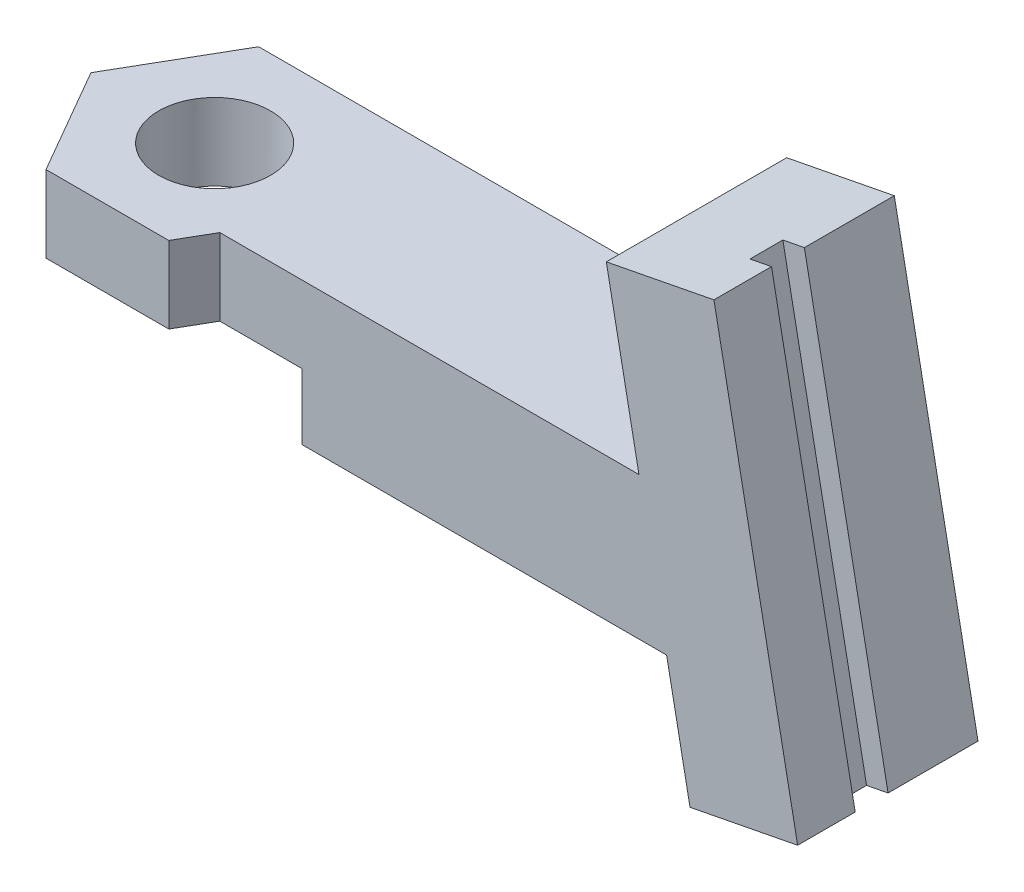
ISO-10303-21;
HEADER;
FILE_DESCRIPTION(('STEP AP214'),'2;1');
FILE_NAME('part.step','',(''),(''),'','','');
FILE_SCHEMA(('AUTOMOTIVE_DESIGN { 1 0 10303 214 1 1 1 1 }'));
ENDSEC;
DATA;
#1=APPLICATION_CONTEXT('core data for automotive mechanical design processes');
#2=APPLICATION_PROTOCOL_DEFINITION('international standard','automotive_design',2000,#1);
#3=PRODUCT_CONTEXT('',#1,'mechanical');
#4=PRODUCT('Part','Part','',(#3));
#5=PRODUCT_RELATED_PRODUCT_CATEGORY('part','',(#4));
#6=PRODUCT_DEFINITION_FORMATION('','',#4);
#7=PRODUCT_DEFINITION_CONTEXT('part definition',#1,'design');
#8=PRODUCT_DEFINITION('design','',#6,#7);
#9=PRODUCT_DEFINITION_SHAPE('','',#8);
#10=(LENGTH_UNIT() NAMED_UNIT(*) SI_UNIT(.MILLI.,.METRE.));
#11=(NAMED_UNIT(*) PLANE_ANGLE_UNIT() SI_UNIT($,.RADIAN.));
#12=(NAMED_UNIT(*) SI_UNIT($,.STERADIAN.) SOLID_ANGLE_UNIT());
#13=UNCERTAINTY_MEASURE_WITH_UNIT(LENGTH_MEASURE(1.E-05),#10,'distance_accuracy_value','');
#14=(GEOMETRIC_REPRESENTATION_CONTEXT(3) GLOBAL_UNCERTAINTY_ASSIGNED_CONTEXT((#13)) GLOBAL_UNIT_ASSIGNED_CONTEXT((#10,
#11,#12)) REPRESENTATION_CONTEXT('',''));
#15=CARTESIAN_POINT('',(0.,0.,0.));
#16=DIRECTION('',(0.,0.,1.));
#17=DIRECTION('',(1.,0.,0.));
#18=AXIS2_PLACEMENT_3D('',#15,#16,#17);
#19=CARTESIAN_POINT('',(2.80014880556968,-14.8169947470239,8.225));
#20=DIRECTION('',(0.866025403784439,0.,0.5));
#21=DIRECTION('',(0.5,0.,-0.866025403784439));
#22=AXIS2_PLACEMENT_3D('',#19,#20,#21);
#23=PLANE('',#22);
#24=DIRECTION('',(0.,1.,0.));
#25=VECTOR('',#24,1.);
#26=CARTESIAN_POINT('',(2.80014880556968,-14.8169947470239,8.225));
#27=LINE('',#26,#25);
#28=CARTESIAN_POINT('',(2.80014880556968,3.,8.225));
#29=VERTEX_POINT('',#28);
#30=CARTESIAN_POINT('',(2.80014880556968,6.5,8.225));
#31=VERTEX_POINT('',#30);
#32=EDGE_CURVE('E245',#29,#31,#27,.T.);
#33=ORIENTED_EDGE('',*,*,#32,.F.);
#34=DIRECTION('',(0.5,0.,-0.866025403784439));
#35=VECTOR('',#34,1.);
#36=CARTESIAN_POINT('',(2.80014880556968,3.,8.225));
#37=LINE('',#36,#35);
#38=CARTESIAN_POINT('',(3.65174045262438,3.,6.75));
#39=VERTEX_POINT('',#38);
#40=EDGE_CURVE('E199',#29,#39,#37,.T.);
#41=ORIENTED_EDGE('',*,*,#40,.T.);
#42=DIRECTION('',(0.,-1.,0.));
#43=VECTOR('',#42,1.);
#44=CARTESIAN_POINT('',(3.65174045262438,6.5,6.75));
#45=LINE('',#44,#43);
#46=CARTESIAN_POINT('',(3.65174045262438,6.5,6.75));
#47=VERTEX_POINT('',#46);
#48=EDGE_CURVE('E227',#47,#39,#45,.T.);
#49=ORIENTED_EDGE('',*,*,#48,.F.);
#50=DIRECTION('',(0.5,0.,-0.866025403784439));
#51=VECTOR('',#50,1.);
#52=CARTESIAN_POINT('',(2.80014880556968,6.5,8.225));
#53=LINE('',#52,#51);
#54=EDGE_CURVE('E237',#31,#47,#53,.T.);
#55=ORIENTED_EDGE('',*,*,#54,.F.);
#56=EDGE_LOOP('',(#33,#41,#49,#55));
#57=FACE_BOUND('',#56,.T.);
#58=ADVANCED_FACE('F40',(#57),#23,.T.);
#59=CARTESIAN_POINT('',(-2.80014880556969,-14.8169947470239,-1.475));
#60=DIRECTION('',(-0.866025403784439,0.,-0.5));
#61=DIRECTION('',(-0.5,0.,0.866025403784439));
#62=AXIS2_PLACEMENT_3D('',#59,#60,#61);
#63=PLANE('',#62);
#64=DIRECTION('',(0.,1.,0.));
#65=VECTOR('',#64,1.);
#66=CARTESIAN_POINT('',(-2.80014880556969,-14.8169947470239,-1.475));
#67=LINE('',#66,#65);
#68=CARTESIAN_POINT('',(-2.80014880556969,3.,-1.475));
#69=VERTEX_POINT('',#68);
#70=CARTESIAN_POINT('',(-2.80014880556969,6.5,-1.475));
#71=VERTEX_POINT('',#70);
#72=EDGE_CURVE('E228',#69,#71,#67,.T.);
#73=ORIENTED_EDGE('',*,*,#72,.F.);
#74=DIRECTION('',(-0.5,0.,0.866025403784439));
#75=VECTOR('',#74,1.);
#76=CARTESIAN_POINT('',(-2.80014880556969,3.,-1.475));
#77=LINE('',#76,#75);
#78=CARTESIAN_POINT('',(-5.60029761113937,3.,3.375));
#79=VERTEX_POINT('',#78);
#80=EDGE_CURVE('E196',#69,#79,#77,.T.);
#81=ORIENTED_EDGE('',*,*,#80,.T.);
#82=DIRECTION('',(0.,1.,0.));
#83=VECTOR('',#82,1.);
#84=CARTESIAN_POINT('',(-5.60029761113937,-14.8169947470239,3.375));
#85=LINE('',#84,#83);
#86=CARTESIAN_POINT('',(-5.60029761113937,6.5,3.375));
#87=VERTEX_POINT('',#86);
#88=EDGE_CURVE('E243',#79,#87,#85,.T.);
#89=ORIENTED_EDGE('',*,*,#88,.T.);
#90=DIRECTION('',(-0.5,0.,0.866025403784439));
#91=VECTOR('',#90,1.);
#92=CARTESIAN_POINT('',(-2.80014880556969,6.5,-1.475));
#93=LINE('',#92,#91);
#94=EDGE_CURVE('E224',#71,#87,#93,.T.);
#95=ORIENTED_EDGE('',*,*,#94,.F.);
#96=EDGE_LOOP('',(#73,#81,#89,#95));
#97=FACE_BOUND('',#96,.T.);
#98=ADVANCED_FACE('F331',(#97),#63,.T.);
#99=CARTESIAN_POINT('',(-2.80014880556968,-14.8169947470239,8.225));
#100=DIRECTION('',(0.,0.,1.));
#101=DIRECTION('',(1.,0.,0.));
#102=AXIS2_PLACEMENT_3D('',#99,#100,#101);
#103=PLANE('',#102);
#104=DIRECTION('',(0.,1.,0.));
#105=VECTOR('',#104,1.);
#106=CARTESIAN_POINT('',(-2.80014880556968,-14.8169947470239,8.225));
#107=LINE('',#106,#105);
#108=CARTESIAN_POINT('',(-2.80014880556968,3.,8.225));
#109=VERTEX_POINT('',#108);
#110=CARTESIAN_POINT('',(-2.80014880556968,6.5,8.225));
#111=VERTEX_POINT('',#110);
#112=EDGE_CURVE('E247',#109,#111,#107,.T.);
#113=ORIENTED_EDGE('',*,*,#112,.F.);
#114=DIRECTION('',(1.,0.,0.));
#115=VECTOR('',#114,1.);
#116=CARTESIAN_POINT('',(-2.80014880556968,3.,8.225));
#117=LINE('',#116,#115);
#118=EDGE_CURVE('E55',#109,#29,#117,.T.);
#119=ORIENTED_EDGE('',*,*,#118,.T.);
#120=ORIENTED_EDGE('',*,*,#32,.T.);
#121=DIRECTION('',(1.,0.,0.));
#122=VECTOR('',#121,1.);
#123=CARTESIAN_POINT('',(-2.80014880556968,6.5,8.225));
#124=LINE('',#123,#122);
#125=EDGE_CURVE('E234',#111,#31,#124,.T.);
#126=ORIENTED_EDGE('',*,*,#125,.F.);
#127=EDGE_LOOP('',(#113,#119,#120,#126));
#128=FACE_BOUND('',#127,.T.);
#129=ADVANCED_FACE('F325',(#128),#103,.T.);
#130=CARTESIAN_POINT('',(-5.60029761113937,-14.8169947470239,3.375));
#131=DIRECTION('',(-0.866025403784439,0.,0.5));
#132=DIRECTION('',(0.5,0.,0.866025403784439));
#133=AXIS2_PLACEMENT_3D('',#130,#131,#132);
#134=PLANE('',#133);
#135=ORIENTED_EDGE('',*,*,#88,.F.);
#136=DIRECTION('',(0.5,0.,0.866025403784439));
#137=VECTOR('',#136,1.);
#138=CARTESIAN_POINT('',(-5.60029761113937,3.,3.375));
#139=LINE('',#138,#137);
#140=EDGE_CURVE('E193',#79,#109,#139,.T.);
#141=ORIENTED_EDGE('',*,*,#140,.T.);
#142=ORIENTED_EDGE('',*,*,#112,.T.);
#143=DIRECTION('',(0.5,0.,0.866025403784439));
#144=VECTOR('',#143,1.);
#145=CARTESIAN_POINT('',(-5.60029761113937,6.5,3.375));
#146=LINE('',#145,#144);
#147=EDGE_CURVE('E231',#87,#111,#146,.T.);
#148=ORIENTED_EDGE('',*,*,#147,.F.);
#149=EDGE_LOOP('',(#135,#141,#142,#148));
#150=FACE_BOUND('',#149,.T.);
#151=ADVANCED_FACE('F315',(#150),#134,.T.);
#152=CARTESIAN_POINT('',(0.,-3.5,3.33561597332667));
#153=DIRECTION('',(0.,1.,0.));
#154=DIRECTION('',(0.,0.,1.));
#155=AXIS2_PLACEMENT_3D('',#152,#153,#154);
#156=CYLINDRICAL_SURFACE('',#155,2.55);
#157=CARTESIAN_POINT('',(0.,6.5,3.33561597332667));
#158=DIRECTION('',(0.,1.,0.));
#159=DIRECTION('',(0.,0.,1.));
#160=AXIS2_PLACEMENT_3D('',#157,#158,#159);
#161=CIRCLE('',#160,2.55);
#162=CARTESIAN_POINT('',(0.,6.5,5.88561597332667));
#163=VERTEX_POINT('',#162);
#164=EDGE_CURVE('E210',#163,#163,#161,.T.);
#165=ORIENTED_EDGE('',*,*,#164,.T.);
#166=EDGE_LOOP('',(#165));
#167=FACE_BOUND('',#166,.T.);
#168=CARTESIAN_POINT('',(0.,3.,3.33561597332667));
#169=DIRECTION('',(0.,-1.,0.));
#170=DIRECTION('',(0.,0.,-1.));
#171=AXIS2_PLACEMENT_3D('',#168,#169,#170);
#172=CIRCLE('',#171,2.55);
#173=CARTESIAN_POINT('',(0.,3.,0.78561597332667));
#174=VERTEX_POINT('',#173);
#175=EDGE_CURVE('E183',#174,#174,#172,.F.);
#176=ORIENTED_EDGE('',*,*,#175,.F.);
#177=EDGE_LOOP('',(#176));
#178=FACE_BOUND('',#177,.T.);
#179=ADVANCED_FACE('F312',(#167,#178),#156,.F.);
#180=CARTESIAN_POINT('',(21.2756841752307,14.1555211805119,-22.3589203380482));
#181=DIRECTION('',(-0.190808995376549,0.981627183447663,0.));
#182=DIRECTION('',(-0.981627183447663,-0.190808995376549,0.));
#183=AXIS2_PLACEMENT_3D('',#180,#181,#182);
#184=PLANE('',#183);
#185=DIRECTION('',(0.,0.,1.));
#186=VECTOR('',#185,1.);
#187=CARTESIAN_POINT('',(25.2021929090214,14.9187571620179,2.625));
#188=LINE('',#187,#186);
#189=CARTESIAN_POINT('',(25.2021929090214,14.9187571620179,2.625));
#190=VERTEX_POINT('',#189);
#191=CARTESIAN_POINT('',(25.2021929090214,14.9187571620179,4.125));
#192=VERTEX_POINT('',#191);
#193=EDGE_CURVE('E256',#190,#192,#188,.T.);
#194=ORIENTED_EDGE('',*,*,#193,.F.);
#195=DIRECTION('',(0.981627183447664,0.190808995376542,0.));
#196=VECTOR('',#195,1.);
#197=CARTESIAN_POINT('',(25.2021929090214,14.9187571620179,2.625));
#198=LINE('',#197,#196);
#199=CARTESIAN_POINT('',(26.183820092469,15.1095661573944,2.625));
#200=VERTEX_POINT('',#199);
#201=EDGE_CURVE('E251',#190,#200,#198,.T.);
#202=ORIENTED_EDGE('',*,*,#201,.T.);
#203=DIRECTION('',(0.,0.,1.));
#204=VECTOR('',#203,1.);
#205=CARTESIAN_POINT('',(26.183820092469,15.1095661573946,-22.3589203380482));
#206=LINE('',#205,#204);
#207=CARTESIAN_POINT('',(26.183820092469,15.1095661573946,-1.475));
#208=VERTEX_POINT('',#207);
#209=EDGE_CURVE('E286',#208,#200,#206,.T.);
#210=ORIENTED_EDGE('',*,*,#209,.F.);
#211=DIRECTION('',(0.981627183447663,0.190808995376549,0.));
#212=VECTOR('',#211,1.);
#213=CARTESIAN_POINT('',(26.183820092469,15.1095661573946,-1.475));
#214=LINE('',#213,#212);
#215=CARTESIAN_POINT('',(21.2756841752307,14.1555211805119,-1.475));
#216=VERTEX_POINT('',#215);
#217=EDGE_CURVE('E217',#216,#208,#214,.T.);
#218=ORIENTED_EDGE('',*,*,#217,.F.);
#219=DIRECTION('',(0.,0.,1.));
#220=VECTOR('',#219,1.);
#221=CARTESIAN_POINT('',(21.2756841752307,14.1555211805119,-22.3589203380482));
#222=LINE('',#221,#220);
#223=CARTESIAN_POINT('',(21.2756841752307,14.1555211805119,6.75));
#224=VERTEX_POINT('',#223);
#225=EDGE_CURVE('E282',#216,#224,#222,.T.);
#226=ORIENTED_EDGE('',*,*,#225,.T.);
#227=DIRECTION('',(0.981627183447663,0.190808995376549,0.));
#228=VECTOR('',#227,1.);
#229=CARTESIAN_POINT('',(21.2756841752307,14.1555211805119,6.75));
#230=LINE('',#229,#228);
#231=CARTESIAN_POINT('',(26.183820092469,15.1095661573946,6.75000000000001));
#232=VERTEX_POINT('',#231);
#233=EDGE_CURVE('E268',#224,#232,#230,.T.);
#234=ORIENTED_EDGE('',*,*,#233,.T.);
#235=CARTESIAN_POINT('',(26.183820092469,15.1095661573944,4.125));
#236=VERTEX_POINT('',#235);
#237=EDGE_CURVE('E289',#236,#232,#206,.T.);
#238=ORIENTED_EDGE('',*,*,#237,.F.);
#239=DIRECTION('',(0.981627183447664,0.190808995376542,0.));
#240=VECTOR('',#239,1.);
#241=CARTESIAN_POINT('',(25.2021929090214,14.9187571620179,4.125));
#242=LINE('',#241,#240);
#243=EDGE_CURVE('E254',#192,#236,#242,.T.);
#244=ORIENTED_EDGE('',*,*,#243,.F.);
#245=EDGE_LOOP('',(#194,#202,#210,#218,#226,#234,#238,#244));
#246=FACE_BOUND('',#245,.T.);
#247=ADVANCED_FACE('F314',(#246),#184,.T.);
#248=CARTESIAN_POINT('',(26.183820092469,15.1095661573946,-22.3589203380482));
#249=DIRECTION('',(0.981627183447663,0.190808995376549,0.));
#250=DIRECTION('',(-0.190808995376549,0.981627183447663,0.));
#251=AXIS2_PLACEMENT_3D('',#248,#249,#250);
#252=PLANE('',#251);
#253=ORIENTED_EDGE('',*,*,#209,.T.);
#254=DIRECTION('',(-0.190808995376542,0.981627183447665,0.));
#255=VECTOR('',#254,1.);
#256=CARTESIAN_POINT('',(30.5724269861295,-7.46785906190183,2.625));
#257=LINE('',#256,#255);
#258=CARTESIAN_POINT('',(29.9999999999999,-4.52297751155865,2.625));
#259=VERTEX_POINT('',#258);
#260=EDGE_CURVE('E266',#259,#200,#257,.T.);
#261=ORIENTED_EDGE('',*,*,#260,.F.);
#262=DIRECTION('',(0.,0.,1.));
#263=VECTOR('',#262,1.);
#264=CARTESIAN_POINT('',(30.,-4.52297751155863,-22.3589203380482));
#265=LINE('',#264,#263);
#266=CARTESIAN_POINT('',(30.,-4.52297751155863,-1.475));
#267=VERTEX_POINT('',#266);
#268=EDGE_CURVE('E290',#267,#259,#265,.T.);
#269=ORIENTED_EDGE('',*,*,#268,.F.);
#270=DIRECTION('',(0.190808995376549,-0.981627183447663,0.));
#271=VECTOR('',#270,1.);
#272=CARTESIAN_POINT('',(30.,-4.52297751155863,-1.475));
#273=LINE('',#272,#271);
#274=EDGE_CURVE('E214',#208,#267,#273,.T.);
#275=ORIENTED_EDGE('',*,*,#274,.F.);
#276=EDGE_LOOP('',(#253,#261,#269,#275));
#277=FACE_BOUND('',#276,.T.);
#278=ADVANCED_FACE('F322',(#277),#252,.T.);
#279=CARTESIAN_POINT('',(30.,-4.52297751155863,-22.3589203380482));
#280=DIRECTION('',(0.190808995376549,-0.981627183447663,0.));
#281=DIRECTION('',(0.981627183447663,0.190808995376549,0.));
#282=AXIS2_PLACEMENT_3D('',#279,#280,#281);
#283=PLANE('',#282);
#284=ORIENTED_EDGE('',*,*,#268,.T.);
#285=DIRECTION('',(-0.981627183447663,-0.190808995376549,0.));
#286=VECTOR('',#285,1.);
#287=CARTESIAN_POINT('',(30.,-4.52297751155863,2.625));
#288=LINE('',#287,#286);
#289=CARTESIAN_POINT('',(29.0183728165522,-4.7137865069352,2.625));
#290=VERTEX_POINT('',#289);
#291=EDGE_CURVE('E48',#259,#290,#288,.T.);
#292=ORIENTED_EDGE('',*,*,#291,.T.);
#293=DIRECTION('',(0.,0.,-1.));
#294=VECTOR('',#293,1.);
#295=CARTESIAN_POINT('',(29.0183728165522,-4.7137865069352,-22.3589203380482));
#296=LINE('',#295,#294);
#297=CARTESIAN_POINT('',(29.0183728165522,-4.7137865069352,4.125));
#298=VERTEX_POINT('',#297);
#299=EDGE_CURVE('E303',#298,#290,#296,.T.);
#300=ORIENTED_EDGE('',*,*,#299,.F.);
#301=DIRECTION('',(-0.981627183447663,-0.190808995376549,0.));
#302=VECTOR('',#301,1.);
#303=CARTESIAN_POINT('',(30.,-4.52297751155862,4.125));
#304=LINE('',#303,#302);
#305=CARTESIAN_POINT('',(29.9999999999999,-4.52297751155865,4.125));
#306=VERTEX_POINT('',#305);
#307=EDGE_CURVE('E305',#306,#298,#304,.T.);
#308=ORIENTED_EDGE('',*,*,#307,.F.);
#309=CARTESIAN_POINT('',(30.,-4.52297751155863,6.75));
#310=VERTEX_POINT('',#309);
#311=EDGE_CURVE('E293',#306,#310,#265,.T.);
#312=ORIENTED_EDGE('',*,*,#311,.T.);
#313=DIRECTION('',(-0.981627183447663,-0.190808995376549,0.));
#314=VECTOR('',#313,1.);
#315=CARTESIAN_POINT('',(30.,-4.52297751155863,6.75));
#316=LINE('',#315,#314);
#317=CARTESIAN_POINT('',(25.0918640827617,-5.47702248844137,6.75));
#318=VERTEX_POINT('',#317);
#319=EDGE_CURVE('E272',#310,#318,#316,.T.);
#320=ORIENTED_EDGE('',*,*,#319,.T.);
#321=DIRECTION('',(0.,0.,1.));
#322=VECTOR('',#321,1.);
#323=CARTESIAN_POINT('',(25.0918640827617,-5.47702248844137,-22.3589203380482));
#324=LINE('',#323,#322);
#325=CARTESIAN_POINT('',(25.0918640827617,-5.47702248844137,-1.475));
#326=VERTEX_POINT('',#325);
#327=EDGE_CURVE('E279',#326,#318,#324,.T.);
#328=ORIENTED_EDGE('',*,*,#327,.F.);
#329=DIRECTION('',(-0.981627183447663,-0.190808995376549,0.));
#330=VECTOR('',#329,1.);
#331=CARTESIAN_POINT('',(25.0918640827617,-5.47702248844137,-1.475));
#332=LINE('',#331,#330);
#333=EDGE_CURVE('E211',#267,#326,#332,.T.);
#334=ORIENTED_EDGE('',*,*,#333,.F.);
#335=EDGE_LOOP('',(#284,#292,#300,#308,#312,#320,#328,#334));
#336=FACE_BOUND('',#335,.T.);
#337=ADVANCED_FACE('F362',(#336),#283,.T.);
#338=CARTESIAN_POINT('',(0.,6.5,6.75));
#339=DIRECTION('',(0.,0.,-1.));
#340=DIRECTION('',(-1.,0.,0.));
#341=AXIS2_PLACEMENT_3D('',#338,#339,#340);
#342=PLANE('',#341);
#343=DIRECTION('',(-1.,0.,0.));
#344=VECTOR('',#343,1.);
#345=CARTESIAN_POINT('',(0.,3.,6.75));
#346=LINE('',#345,#344);
#347=CARTESIAN_POINT('',(7.40451720235695,3.,6.75));
#348=VERTEX_POINT('',#347);
#349=EDGE_CURVE('E202',#348,#39,#346,.T.);
#350=ORIENTED_EDGE('',*,*,#349,.F.);
#351=DIRECTION('',(0.,-1.,0.));
#352=VECTOR('',#351,1.);
#353=CARTESIAN_POINT('',(7.40451720235695,6.5,6.75));
#354=LINE('',#353,#352);
#355=CARTESIAN_POINT('',(7.40451720235695,0.,6.75));
#356=VERTEX_POINT('',#355);
#357=EDGE_CURVE('E187',#348,#356,#354,.T.);
#358=ORIENTED_EDGE('',*,*,#357,.T.);
#359=DIRECTION('',(1.,0.,0.));
#360=VECTOR('',#359,1.);
#361=CARTESIAN_POINT('',(0.,0.,6.75));
#362=LINE('',#361,#360);
#363=CARTESIAN_POINT('',(24.0272387583042,0.,6.75));
#364=VERTEX_POINT('',#363);
#365=EDGE_CURVE('E297',#356,#364,#362,.T.);
#366=ORIENTED_EDGE('',*,*,#365,.T.);
#367=DIRECTION('',(-0.190808995376549,0.981627183447663,0.));
#368=VECTOR('',#367,1.);
#369=CARTESIAN_POINT('',(25.0918640827617,-5.47702248844137,6.75));
#370=LINE('',#369,#368);
#371=EDGE_CURVE('E276',#318,#364,#370,.T.);
#372=ORIENTED_EDGE('',*,*,#371,.F.);
#373=ORIENTED_EDGE('',*,*,#319,.F.);
#374=DIRECTION('',(0.190808995376549,-0.981627183447663,0.));
#375=VECTOR('',#374,1.);
#376=CARTESIAN_POINT('',(26.183820092469,15.1095661573946,6.75));
#377=LINE('',#376,#375);
#378=EDGE_CURVE('E269',#232,#310,#377,.T.);
#379=ORIENTED_EDGE('',*,*,#378,.F.);
#380=ORIENTED_EDGE('',*,*,#233,.F.);
#381=CARTESIAN_POINT('',(22.763766748909,6.5,6.75));
#382=VERTEX_POINT('',#381);
#383=EDGE_CURVE('E275',#382,#224,#370,.T.);
#384=ORIENTED_EDGE('',*,*,#383,.F.);
#385=DIRECTION('',(1.,0.,0.));
#386=VECTOR('',#385,1.);
#387=CARTESIAN_POINT('',(0.,6.5,6.75));
#388=LINE('',#387,#386);
#389=EDGE_CURVE('E63',#47,#382,#388,.T.);
#390=ORIENTED_EDGE('',*,*,#389,.F.);
#391=ORIENTED_EDGE('',*,*,#48,.T.);
#392=EDGE_LOOP('',(#350,#358,#366,#372,#373,#379,#380,#384,#390,#391));
#393=FACE_BOUND('',#392,.T.);
#394=ADVANCED_FACE('F42',(#393),#342,.F.);
#395=CARTESIAN_POINT('',(0.,6.5,0.));
#396=DIRECTION('',(0.,1.,0.));
#397=DIRECTION('',(0.,0.,1.));
#398=AXIS2_PLACEMENT_3D('',#395,#396,#397);
#399=PLANE('',#398);
#400=DIRECTION('',(0.,0.,1.));
#401=VECTOR('',#400,1.);
#402=CARTESIAN_POINT('',(22.763766748909,6.5,0.));
#403=LINE('',#402,#401);
#404=CARTESIAN_POINT('',(22.763766748909,6.5,-1.475));
#405=VERTEX_POINT('',#404);
#406=EDGE_CURVE('E285',#405,#382,#403,.T.);
#407=ORIENTED_EDGE('',*,*,#406,.F.);
#408=DIRECTION('',(-1.,0.,0.));
#409=VECTOR('',#408,1.);
#410=CARTESIAN_POINT('',(2.80014880556968,6.5,-1.475));
#411=LINE('',#410,#409);
#412=EDGE_CURVE('E240',#405,#71,#411,.T.);
#413=ORIENTED_EDGE('',*,*,#412,.T.);
#414=ORIENTED_EDGE('',*,*,#94,.T.);
#415=ORIENTED_EDGE('',*,*,#147,.T.);
#416=ORIENTED_EDGE('',*,*,#125,.T.);
#417=ORIENTED_EDGE('',*,*,#54,.T.);
#418=ORIENTED_EDGE('',*,*,#389,.T.);
#419=EDGE_LOOP('',(#407,#413,#414,#415,#416,#417,#418));
#420=FACE_BOUND('',#419,.T.);
#421=ORIENTED_EDGE('',*,*,#164,.F.);
#422=EDGE_LOOP('',(#421));
#423=FACE_BOUND('',#422,.T.);
#424=ADVANCED_FACE('F370',(#420,#423),#399,.T.);
#425=CARTESIAN_POINT('',(0.,0.,0.));
#426=DIRECTION('',(0.,1.,0.));
#427=DIRECTION('',(0.,0.,1.));
#428=AXIS2_PLACEMENT_3D('',#425,#426,#427);
#429=PLANE('',#428);
#430=ORIENTED_EDGE('',*,*,#365,.F.);
#431=DIRECTION('',(-0.5,0.,0.866025403784439));
#432=VECTOR('',#431,1.);
#433=CARTESIAN_POINT('',(9.35307436087194,0.,3.375));
#434=LINE('',#433,#432);
#435=CARTESIAN_POINT('',(9.35307436087194,0.,3.375));
#436=VERTEX_POINT('',#435);
#437=EDGE_CURVE('E189',#436,#356,#434,.T.);
#438=ORIENTED_EDGE('',*,*,#437,.F.);
#439=DIRECTION('',(0.5,0.,0.866025403784439));
#440=VECTOR('',#439,1.);
#441=CARTESIAN_POINT('',(4.67653718043597,0.,-4.725));
#442=LINE('',#441,#440);
#443=CARTESIAN_POINT('',(6.55292555530225,0.,-1.475));
#444=VERTEX_POINT('',#443);
#445=EDGE_CURVE('E180',#444,#436,#442,.T.);
#446=ORIENTED_EDGE('',*,*,#445,.F.);
#447=DIRECTION('',(1.,0.,0.));
#448=VECTOR('',#447,1.);
#449=CARTESIAN_POINT('',(2.80014880556968,0.,-1.475));
#450=LINE('',#449,#448);
#451=CARTESIAN_POINT('',(24.0272387583042,0.,-1.475));
#452=VERTEX_POINT('',#451);
#453=EDGE_CURVE('E225',#444,#452,#450,.T.);
#454=ORIENTED_EDGE('',*,*,#453,.T.);
#455=DIRECTION('',(0.,0.,1.));
#456=VECTOR('',#455,1.);
#457=CARTESIAN_POINT('',(24.0272387583042,0.,0.));
#458=LINE('',#457,#456);
#459=EDGE_CURVE('E299',#452,#364,#458,.T.);
#460=ORIENTED_EDGE('',*,*,#459,.T.);
#461=EDGE_LOOP('',(#430,#438,#446,#454,#460));
#462=FACE_BOUND('',#461,.T.);
#463=ADVANCED_FACE('F372',(#462),#429,.F.);
#464=CARTESIAN_POINT('',(25.0918640827617,-5.47702248844137,-22.3589203380482));
#465=DIRECTION('',(-0.981627183447663,-0.190808995376549,0.));
#466=DIRECTION('',(0.190808995376549,-0.981627183447663,0.));
#467=AXIS2_PLACEMENT_3D('',#464,#465,#466);
#468=PLANE('',#467);
#469=ORIENTED_EDGE('',*,*,#459,.F.);
#470=DIRECTION('',(-0.190808995376549,0.981627183447663,0.));
#471=VECTOR('',#470,1.);
#472=CARTESIAN_POINT('',(24.0272387583042,0.,-1.475));
#473=LINE('',#472,#471);
#474=EDGE_CURVE('E207',#326,#452,#473,.T.);
#475=ORIENTED_EDGE('',*,*,#474,.F.);
#476=ORIENTED_EDGE('',*,*,#327,.T.);
#477=ORIENTED_EDGE('',*,*,#371,.T.);
#478=EDGE_LOOP('',(#469,#475,#476,#477));
#479=FACE_BOUND('',#478,.T.);
#480=ADVANCED_FACE('F368',(#479),#468,.T.);
#481=ORIENTED_EDGE('',*,*,#225,.F.);
#482=DIRECTION('',(-0.190808995376549,0.981627183447663,0.));
#483=VECTOR('',#482,1.);
#484=CARTESIAN_POINT('',(21.2756841752307,14.1555211805119,-1.475));
#485=LINE('',#484,#483);
#486=EDGE_CURVE('E206',#405,#216,#485,.T.);
#487=ORIENTED_EDGE('',*,*,#486,.F.);
#488=ORIENTED_EDGE('',*,*,#406,.T.);
#489=ORIENTED_EDGE('',*,*,#383,.T.);
#490=EDGE_LOOP('',(#481,#487,#488,#489));
#491=FACE_BOUND('',#490,.T.);
#492=ADVANCED_FACE('F360',(#491),#468,.T.);
#493=DIRECTION('',(-0.190808995376542,0.981627183447665,0.));
#494=VECTOR('',#493,1.);
#495=CARTESIAN_POINT('',(30.5724269861295,-7.46785906190183,4.125));
#496=LINE('',#495,#494);
#497=EDGE_CURVE('E263',#306,#236,#496,.T.);
#498=ORIENTED_EDGE('',*,*,#497,.T.);
#499=ORIENTED_EDGE('',*,*,#237,.T.);
#500=ORIENTED_EDGE('',*,*,#378,.T.);
#501=ORIENTED_EDGE('',*,*,#311,.F.);
#502=EDGE_LOOP('',(#498,#499,#500,#501));
#503=FACE_BOUND('',#502,.T.);
#504=ADVANCED_FACE('F355',(#503),#252,.T.);
#505=CARTESIAN_POINT('',(29.5907998026819,-7.65866805727838,2.625));
#506=DIRECTION('',(0.,0.,1.));
#507=DIRECTION('',(1.,0.,0.));
#508=AXIS2_PLACEMENT_3D('',#505,#506,#507);
#509=PLANE('',#508);
#510=ORIENTED_EDGE('',*,*,#260,.T.);
#511=ORIENTED_EDGE('',*,*,#201,.F.);
#512=DIRECTION('',(-0.190808995376542,0.981627183447665,0.));
#513=VECTOR('',#512,1.);
#514=CARTESIAN_POINT('',(29.5907998026819,-7.65866805727838,2.625));
#515=LINE('',#514,#513);
#516=EDGE_CURVE('E259',#290,#190,#515,.T.);
#517=ORIENTED_EDGE('',*,*,#516,.F.);
#518=ORIENTED_EDGE('',*,*,#291,.F.);
#519=EDGE_LOOP('',(#510,#511,#517,#518));
#520=FACE_BOUND('',#519,.T.);
#521=ADVANCED_FACE('F352',(#520),#509,.T.);
#522=CARTESIAN_POINT('',(29.5907998026819,-7.65866805727838,4.125));
#523=DIRECTION('',(0.,0.,1.));
#524=DIRECTION('',(1.,0.,0.));
#525=AXIS2_PLACEMENT_3D('',#522,#523,#524);
#526=PLANE('',#525);
#527=ORIENTED_EDGE('',*,*,#307,.T.);
#528=DIRECTION('',(-0.190808995376542,0.981627183447665,0.));
#529=VECTOR('',#528,1.);
#530=CARTESIAN_POINT('',(29.5907998026819,-7.65866805727838,4.125));
#531=LINE('',#530,#529);
#532=EDGE_CURVE('E261',#298,#192,#531,.T.);
#533=ORIENTED_EDGE('',*,*,#532,.T.);
#534=ORIENTED_EDGE('',*,*,#243,.T.);
#535=ORIENTED_EDGE('',*,*,#497,.F.);
#536=EDGE_LOOP('',(#527,#533,#534,#535));
#537=FACE_BOUND('',#536,.T.);
#538=ADVANCED_FACE('F348',(#537),#526,.F.);
#539=CARTESIAN_POINT('',(29.5907998026819,-7.65866805727838,2.625));
#540=DIRECTION('',(-0.981627183447665,-0.190808995376542,0.));
#541=DIRECTION('',(0.190808995376542,-0.981627183447665,0.));
#542=AXIS2_PLACEMENT_3D('',#539,#540,#541);
#543=PLANE('',#542);
#544=ORIENTED_EDGE('',*,*,#299,.T.);
#545=ORIENTED_EDGE('',*,*,#516,.T.);
#546=ORIENTED_EDGE('',*,*,#193,.T.);
#547=ORIENTED_EDGE('',*,*,#532,.F.);
#548=EDGE_LOOP('',(#544,#545,#546,#547));
#549=FACE_BOUND('',#548,.T.);
#550=ADVANCED_FACE('F345',(#549),#543,.F.);
#551=CARTESIAN_POINT('',(2.80014880556968,-14.8169947470239,-1.475));
#552=DIRECTION('',(0.,0.,-1.));
#553=DIRECTION('',(-1.,0.,0.));
#554=AXIS2_PLACEMENT_3D('',#551,#552,#553);
#555=PLANE('',#554);
#556=DIRECTION('',(0.,-1.,0.));
#557=VECTOR('',#556,1.);
#558=CARTESIAN_POINT('',(6.55292555530225,-14.8169947470239,-1.475));
#559=LINE('',#558,#557);
#560=CARTESIAN_POINT('',(6.55292555530225,3.,-1.475));
#561=VERTEX_POINT('',#560);
#562=EDGE_CURVE('E11',#561,#444,#559,.T.);
#563=ORIENTED_EDGE('',*,*,#562,.F.);
#564=DIRECTION('',(-1.,0.,0.));
#565=VECTOR('',#564,1.);
#566=CARTESIAN_POINT('',(2.80014880556968,3.,-1.475));
#567=LINE('',#566,#565);
#568=EDGE_CURVE('E172',#561,#69,#567,.T.);
#569=ORIENTED_EDGE('',*,*,#568,.T.);
#570=ORIENTED_EDGE('',*,*,#72,.T.);
#571=ORIENTED_EDGE('',*,*,#412,.F.);
#572=ORIENTED_EDGE('',*,*,#486,.T.);
#573=ORIENTED_EDGE('',*,*,#217,.T.);
#574=ORIENTED_EDGE('',*,*,#274,.T.);
#575=ORIENTED_EDGE('',*,*,#333,.T.);
#576=ORIENTED_EDGE('',*,*,#474,.T.);
#577=ORIENTED_EDGE('',*,*,#453,.F.);
#578=EDGE_LOOP('',(#563,#569,#570,#571,#572,#573,#574,#575,#576,#577));
#579=FACE_BOUND('',#578,.T.);
#580=ADVANCED_FACE('F341',(#579),#555,.T.);
#581=CARTESIAN_POINT('',(9.35307436087194,3.,3.375));
#582=DIRECTION('',(0.866025403784438,0.,0.5));
#583=DIRECTION('',(0.5,0.,-0.866025403784439));
#584=AXIS2_PLACEMENT_3D('',#581,#582,#583);
#585=PLANE('',#584);
#586=DIRECTION('',(-0.5,0.,0.866025403784439));
#587=VECTOR('',#586,1.);
#588=CARTESIAN_POINT('',(9.35307436087194,3.,3.375));
#589=LINE('',#588,#587);
#590=CARTESIAN_POINT('',(9.35307436087194,3.,3.375));
#591=VERTEX_POINT('',#590);
#592=EDGE_CURVE('E169',#591,#348,#589,.T.);
#593=ORIENTED_EDGE('',*,*,#592,.F.);
#594=DIRECTION('',(0.,-1.,0.));
#595=VECTOR('',#594,1.);
#596=CARTESIAN_POINT('',(9.35307436087194,3.,3.375));
#597=LINE('',#596,#595);
#598=EDGE_CURVE('E175',#591,#436,#597,.T.);
#599=ORIENTED_EDGE('',*,*,#598,.T.);
#600=ORIENTED_EDGE('',*,*,#437,.T.);
#601=ORIENTED_EDGE('',*,*,#357,.F.);
#602=EDGE_LOOP('',(#593,#599,#600,#601));
#603=FACE_BOUND('',#602,.T.);
#604=ADVANCED_FACE('F185',(#603),#585,.F.);
#605=CARTESIAN_POINT('',(0.,3.,0.));
#606=DIRECTION('',(0.,-1.,0.));
#607=DIRECTION('',(0.,0.,-1.));
#608=AXIS2_PLACEMENT_3D('',#605,#606,#607);
#609=PLANE('',#608);
#610=DIRECTION('',(0.5,0.,0.866025403784439));
#611=VECTOR('',#610,1.);
#612=CARTESIAN_POINT('',(4.67653718043597,3.,-4.725));
#613=LINE('',#612,#611);
#614=EDGE_CURVE('E164',#561,#591,#613,.T.);
#615=ORIENTED_EDGE('',*,*,#614,.T.);
#616=ORIENTED_EDGE('',*,*,#592,.T.);
#617=ORIENTED_EDGE('',*,*,#349,.T.);
#618=ORIENTED_EDGE('',*,*,#40,.F.);
#619=ORIENTED_EDGE('',*,*,#118,.F.);
#620=ORIENTED_EDGE('',*,*,#140,.F.);
#621=ORIENTED_EDGE('',*,*,#80,.F.);
#622=ORIENTED_EDGE('',*,*,#568,.F.);
#623=EDGE_LOOP('',(#615,#616,#617,#618,#619,#620,#621,#622));
#624=FACE_BOUND('',#623,.T.);
#625=ORIENTED_EDGE('',*,*,#175,.T.);
#626=EDGE_LOOP('',(#625));
#627=FACE_BOUND('',#626,.T.);
#628=ADVANCED_FACE('F166',(#624,#627),#609,.T.);
#629=CARTESIAN_POINT('',(4.67653718043597,3.,-4.725));
#630=DIRECTION('',(0.866025403784439,0.,-0.5));
#631=DIRECTION('',(-0.5,0.,-0.866025403784439));
#632=AXIS2_PLACEMENT_3D('',#629,#630,#631);
#633=PLANE('',#632);
#634=ORIENTED_EDGE('',*,*,#562,.T.);
#635=ORIENTED_EDGE('',*,*,#445,.T.);
#636=ORIENTED_EDGE('',*,*,#598,.F.);
#637=ORIENTED_EDGE('',*,*,#614,.F.);
#638=EDGE_LOOP('',(#634,#635,#636,#637));
#639=FACE_BOUND('',#638,.T.);
#640=ADVANCED_FACE('F178',(#639),#633,.F.);
#641=CLOSED_SHELL('',(#58,#98,#129,#151,#179,#247,#278,#337,#394,#424,#463,#480,#492,#504,#521,
#538,#550,#580,#604,#628,#640));
#642=MANIFOLD_SOLID_BREP('B2',#641);
#643=ADVANCED_BREP_SHAPE_REPRESENTATION('',(#18,#642),#14);
#644=SHAPE_DEFINITION_REPRESENTATION(#9,#643);
ENDSEC;
END-ISO-10303-21;
